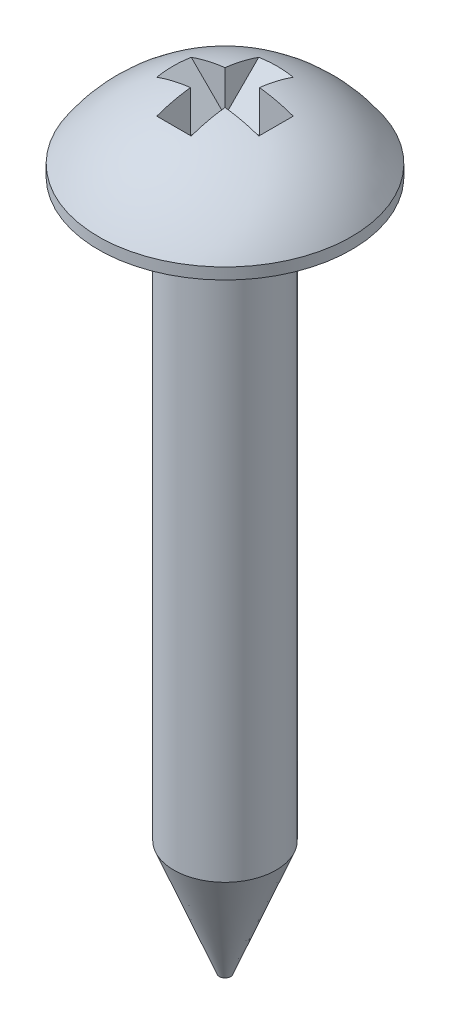
ISO-10303-21;
HEADER;
FILE_DESCRIPTION(('STEP AP214'),'2;1');
FILE_NAME('part.step','',(''),(''),'','','');
FILE_SCHEMA(('AUTOMOTIVE_DESIGN { 1 0 10303 214 1 1 1 1 }'));
ENDSEC;
DATA;
#1=APPLICATION_CONTEXT('core data for automotive mechanical design processes');
#2=APPLICATION_PROTOCOL_DEFINITION('international standard','automotive_design',2000,#1);
#3=PRODUCT_CONTEXT('',#1,'mechanical');
#4=PRODUCT('Part','Part','',(#3));
#5=PRODUCT_RELATED_PRODUCT_CATEGORY('part','',(#4));
#6=PRODUCT_DEFINITION_FORMATION('','',#4);
#7=PRODUCT_DEFINITION_CONTEXT('part definition',#1,'design');
#8=PRODUCT_DEFINITION('design','',#6,#7);
#9=PRODUCT_DEFINITION_SHAPE('','',#8);
#10=(LENGTH_UNIT() NAMED_UNIT(*) SI_UNIT(.MILLI.,.METRE.));
#11=(NAMED_UNIT(*) PLANE_ANGLE_UNIT() SI_UNIT($,.RADIAN.));
#12=(NAMED_UNIT(*) SI_UNIT($,.STERADIAN.) SOLID_ANGLE_UNIT());
#13=UNCERTAINTY_MEASURE_WITH_UNIT(LENGTH_MEASURE(1.E-05),#10,'distance_accuracy_value','');
#14=(GEOMETRIC_REPRESENTATION_CONTEXT(3) GLOBAL_UNCERTAINTY_ASSIGNED_CONTEXT((#13)) GLOBAL_UNIT_ASSIGNED_CONTEXT((#10,
#11,#12)) REPRESENTATION_CONTEXT('',''));
#15=CARTESIAN_POINT('',(0.,0.,0.));
#16=DIRECTION('',(0.,0.,1.));
#17=DIRECTION('',(1.,0.,0.));
#18=AXIS2_PLACEMENT_3D('',#15,#16,#17);
#19=CARTESIAN_POINT('',(0.,-1.60214533333333,0.));
#20=DIRECTION('',(0.,-1.,0.));
#21=DIRECTION('',(1.,0.,0.));
#22=AXIS2_PLACEMENT_3D('',#19,#20,#21);
#23=SPHERICAL_SURFACE('',#22,3.35214533333333);
#24=CARTESIAN_POINT('',(0.,0.25,0.));
#25=DIRECTION('',(0.,-1.,0.));
#26=DIRECTION('',(0.,0.,-1.));
#27=AXIS2_PLACEMENT_3D('',#24,#25,#26);
#28=CIRCLE('',#27,2.794);
#29=CARTESIAN_POINT('',(0.,0.25,-2.794));
#30=VERTEX_POINT('',#29);
#31=EDGE_CURVE('E167',#30,#30,#28,.T.);
#32=ORIENTED_EDGE('',*,*,#31,.F.);
#33=EDGE_LOOP('',(#32));
#34=FACE_BOUND('',#33,.T.);
#35=CARTESIAN_POINT('',(0.,-0.598016146644055,1.00412918668928));
#36=DIRECTION('',(0.,-0.707106781186548,-0.707106781186547));
#37=DIRECTION('',(0.,0.707106781186547,-0.707106781186548));
#38=AXIS2_PLACEMENT_3D('',#35,#36,#37);
#39=CIRCLE('',#38,3.03649921598309);
#40=CARTESIAN_POINT('',(0.381000000000004,1.53214423331163,-1.12603119326641));
#41=VERTEX_POINT('',#40);
#42=CARTESIAN_POINT('',(-0.380999999999996,1.53214423331163,-1.12603119326641));
#43=VERTEX_POINT('',#42);
#44=EDGE_CURVE('E152',#41,#43,#39,.F.);
#45=ORIENTED_EDGE('',*,*,#44,.F.);
#46=CARTESIAN_POINT('',(0.381,-1.60214533333333,0.));
#47=DIRECTION('',(-1.,0.,0.));
#48=DIRECTION('',(0.,0.,1.));
#49=AXIS2_PLACEMENT_3D('',#46,#47,#48);
#50=CIRCLE('',#49,3.33042299652588);
#51=CARTESIAN_POINT('',(0.381000000000001,1.70641271146329,-0.381));
#52=VERTEX_POINT('',#51);
#53=EDGE_CURVE('E105',#41,#52,#50,.F.);
#54=ORIENTED_EDGE('',*,*,#53,.T.);
#55=CARTESIAN_POINT('',(0.,-1.60214533333333,-0.381));
#56=DIRECTION('',(0.,0.,1.));
#57=DIRECTION('',(1.,0.,0.));
#58=AXIS2_PLACEMENT_3D('',#55,#56,#57);
#59=CIRCLE('',#58,3.33042299652588);
#60=CARTESIAN_POINT('',(1.12603119326641,1.53214423331163,-0.381));
#61=VERTEX_POINT('',#60);
#62=EDGE_CURVE('E128',#52,#61,#59,.F.);
#63=ORIENTED_EDGE('',*,*,#62,.T.);
#64=CARTESIAN_POINT('',(-1.00412918668928,-0.598016146644056,0.));
#65=DIRECTION('',(0.707106781186547,-0.707106781186548,0.));
#66=DIRECTION('',(0.707106781186548,0.707106781186547,0.));
#67=AXIS2_PLACEMENT_3D('',#64,#65,#66);
#68=CIRCLE('',#67,3.03649921598309);
#69=CARTESIAN_POINT('',(1.12603119326641,1.53214423331163,0.381));
#70=VERTEX_POINT('',#69);
#71=EDGE_CURVE('E146',#70,#61,#68,.F.);
#72=ORIENTED_EDGE('',*,*,#71,.F.);
#73=CARTESIAN_POINT('',(0.,-1.60214533333333,0.381));
#74=DIRECTION('',(0.,0.,1.));
#75=DIRECTION('',(1.,0.,0.));
#76=AXIS2_PLACEMENT_3D('',#73,#74,#75);
#77=CIRCLE('',#76,3.33042299652588);
#78=CARTESIAN_POINT('',(0.380999999999999,1.70641271146329,0.381));
#79=VERTEX_POINT('',#78);
#80=EDGE_CURVE('E170',#79,#70,#77,.F.);
#81=ORIENTED_EDGE('',*,*,#80,.F.);
#82=CARTESIAN_POINT('',(0.380999999999996,1.53214423331163,1.12603119326641));
#83=VERTEX_POINT('',#82);
#84=EDGE_CURVE('E129',#79,#83,#50,.F.);
#85=ORIENTED_EDGE('',*,*,#84,.T.);
#86=CARTESIAN_POINT('',(0.,-0.598016146644056,-1.00412918668928));
#87=DIRECTION('',(0.,-0.707106781186548,0.707106781186547));
#88=DIRECTION('',(0.,-0.707106781186547,-0.707106781186548));
#89=AXIS2_PLACEMENT_3D('',#86,#87,#88);
#90=CIRCLE('',#89,3.03649921598309);
#91=CARTESIAN_POINT('',(-0.381000000000004,1.53214423331163,1.12603119326641));
#92=VERTEX_POINT('',#91);
#93=EDGE_CURVE('E191',#92,#83,#90,.F.);
#94=ORIENTED_EDGE('',*,*,#93,.F.);
#95=CARTESIAN_POINT('',(-0.381,-1.60214533333333,0.));
#96=DIRECTION('',(-1.,0.,0.));
#97=DIRECTION('',(0.,0.,1.));
#98=AXIS2_PLACEMENT_3D('',#95,#96,#97);
#99=CIRCLE('',#98,3.33042299652588);
#100=CARTESIAN_POINT('',(-0.381000000000001,1.70641271146329,0.381));
#101=VERTEX_POINT('',#100);
#102=EDGE_CURVE('E189',#101,#92,#99,.F.);
#103=ORIENTED_EDGE('',*,*,#102,.F.);
#104=CARTESIAN_POINT('',(-1.12603119326641,1.53214423331163,0.381));
#105=VERTEX_POINT('',#104);
#106=EDGE_CURVE('E171',#105,#101,#77,.F.);
#107=ORIENTED_EDGE('',*,*,#106,.F.);
#108=CARTESIAN_POINT('',(1.00412918668928,-0.598016146644055,0.));
#109=DIRECTION('',(-0.707106781186547,-0.707106781186548,0.));
#110=DIRECTION('',(0.707106781186548,-0.707106781186547,0.));
#111=AXIS2_PLACEMENT_3D('',#108,#109,#110);
#112=CIRCLE('',#111,3.03649921598309);
#113=CARTESIAN_POINT('',(-1.12603119326641,1.53214423331163,-0.381));
#114=VERTEX_POINT('',#113);
#115=EDGE_CURVE('E173',#114,#105,#112,.F.);
#116=ORIENTED_EDGE('',*,*,#115,.F.);
#117=CARTESIAN_POINT('',(-0.380999999999999,1.70641271146329,-0.381));
#118=VERTEX_POINT('',#117);
#119=EDGE_CURVE('E176',#114,#118,#59,.F.);
#120=ORIENTED_EDGE('',*,*,#119,.T.);
#121=EDGE_CURVE('E48',#43,#118,#99,.F.);
#122=ORIENTED_EDGE('',*,*,#121,.F.);
#123=EDGE_LOOP('',(#45,#54,#63,#72,#81,#85,#94,#103,#107,#116,#120,#122));
#124=FACE_BOUND('',#123,.T.);
#125=ADVANCED_FACE('F33',(#34,#124),#23,.T.);
#126=CARTESIAN_POINT('',(0.,0.,-0.381));
#127=DIRECTION('',(0.,0.,1.));
#128=DIRECTION('',(1.,0.,0.));
#129=AXIS2_PLACEMENT_3D('',#126,#127,#128);
#130=PLANE('',#129);
#131=ORIENTED_EDGE('',*,*,#62,.F.);
#132=DIRECTION('',(0.,-1.,0.));
#133=VECTOR('',#132,1.);
#134=CARTESIAN_POINT('',(0.381000000000001,0.,-0.381));
#135=LINE('',#134,#133);
#136=CARTESIAN_POINT('',(0.381000000000001,0.78711304004522,-0.380999999999999));
#137=VERTEX_POINT('',#136);
#138=EDGE_CURVE('E103',#52,#137,#135,.T.);
#139=ORIENTED_EDGE('',*,*,#138,.T.);
#140=DIRECTION('',(0.707106781186548,0.707106781186547,0.));
#141=VECTOR('',#140,1.);
#142=CARTESIAN_POINT('',(0.381,0.78711304004522,-0.381));
#143=LINE('',#142,#141);
#144=EDGE_CURVE('E120',#137,#61,#143,.T.);
#145=ORIENTED_EDGE('',*,*,#144,.T.);
#146=EDGE_LOOP('',(#131,#139,#145));
#147=FACE_BOUND('',#146,.T.);
#148=ADVANCED_FACE('F126',(#147),#130,.T.);
#149=CARTESIAN_POINT('',(0.,0.,0.381));
#150=DIRECTION('',(0.,0.,1.));
#151=DIRECTION('',(1.,0.,0.));
#152=AXIS2_PLACEMENT_3D('',#149,#150,#151);
#153=PLANE('',#152);
#154=DIRECTION('',(0.,-1.,0.));
#155=VECTOR('',#154,1.);
#156=CARTESIAN_POINT('',(0.380999999999999,0.,0.381));
#157=LINE('',#156,#155);
#158=CARTESIAN_POINT('',(0.380999999999999,0.78711304004522,0.381000000000001));
#159=VERTEX_POINT('',#158);
#160=EDGE_CURVE('E11',#79,#159,#157,.T.);
#161=ORIENTED_EDGE('',*,*,#160,.F.);
#162=ORIENTED_EDGE('',*,*,#80,.T.);
#163=DIRECTION('',(0.707106781186548,0.707106781186547,0.));
#164=VECTOR('',#163,1.);
#165=CARTESIAN_POINT('',(0.381,0.78711304004522,0.381));
#166=LINE('',#165,#164);
#167=EDGE_CURVE('E154',#159,#70,#166,.T.);
#168=ORIENTED_EDGE('',*,*,#167,.F.);
#169=EDGE_LOOP('',(#161,#162,#168));
#170=FACE_BOUND('',#169,.T.);
#171=ADVANCED_FACE('F227',(#170),#153,.F.);
#172=CARTESIAN_POINT('',(0.,-15.24,0.));
#173=DIRECTION('',(0.,-1.,0.));
#174=DIRECTION('',(0.,0.,-1.));
#175=AXIS2_PLACEMENT_3D('',#172,#173,#174);
#176=PLANE('',#175);
#177=CARTESIAN_POINT('',(0.,-15.24,0.));
#178=DIRECTION('',(0.,-1.,0.));
#179=DIRECTION('',(0.,0.,-1.));
#180=AXIS2_PLACEMENT_3D('',#177,#178,#179);
#181=CIRCLE('',#180,0.125);
#182=CARTESIAN_POINT('',(0.,-15.24,-0.125));
#183=VERTEX_POINT('',#182);
#184=EDGE_CURVE('E140',#183,#183,#181,.T.);
#185=ORIENTED_EDGE('',*,*,#184,.T.);
#186=EDGE_LOOP('',(#185));
#187=FACE_BOUND('',#186,.T.);
#188=ADVANCED_FACE('F35',(#187),#176,.T.);
#189=CARTESIAN_POINT('',(0.,0.,0.));
#190=DIRECTION('',(0.,-1.,0.));
#191=DIRECTION('',(0.,0.,-1.));
#192=AXIS2_PLACEMENT_3D('',#189,#190,#191);
#193=CYLINDRICAL_SURFACE('',#192,2.794);
#194=ORIENTED_EDGE('',*,*,#31,.T.);
#195=EDGE_LOOP('',(#194));
#196=FACE_BOUND('',#195,.T.);
#197=CARTESIAN_POINT('',(0.,0.,0.));
#198=DIRECTION('',(0.,-1.,0.));
#199=DIRECTION('',(0.,0.,-1.));
#200=AXIS2_PLACEMENT_3D('',#197,#198,#199);
#201=CIRCLE('',#200,2.794);
#202=CARTESIAN_POINT('',(0.,0.,-2.794));
#203=VERTEX_POINT('',#202);
#204=EDGE_CURVE('E164',#203,#203,#201,.T.);
#205=ORIENTED_EDGE('',*,*,#204,.F.);
#206=EDGE_LOOP('',(#205));
#207=FACE_BOUND('',#206,.T.);
#208=ADVANCED_FACE('F231',(#196,#207),#193,.T.);
#209=CARTESIAN_POINT('',(1.13,0.,0.));
#210=DIRECTION('',(0.,-1.,0.));
#211=DIRECTION('',(0.,0.,-1.));
#212=AXIS2_PLACEMENT_3D('',#209,#210,#211);
#213=PLANE('',#212);
#214=ORIENTED_EDGE('',*,*,#204,.T.);
#215=EDGE_LOOP('',(#214));
#216=FACE_BOUND('',#215,.T.);
#217=CARTESIAN_POINT('',(0.,0.,0.));
#218=DIRECTION('',(0.,-1.,0.));
#219=DIRECTION('',(0.,0.,-1.));
#220=AXIS2_PLACEMENT_3D('',#217,#218,#219);
#221=CIRCLE('',#220,1.13);
#222=CARTESIAN_POINT('',(0.,0.,-1.13));
#223=VERTEX_POINT('',#222);
#224=EDGE_CURVE('E161',#223,#223,#221,.T.);
#225=ORIENTED_EDGE('',*,*,#224,.F.);
#226=EDGE_LOOP('',(#225));
#227=FACE_BOUND('',#226,.T.);
#228=ADVANCED_FACE('F234',(#216,#227),#213,.T.);
#229=CARTESIAN_POINT('',(0.,0.,0.));
#230=DIRECTION('',(0.,-1.,0.));
#231=DIRECTION('',(0.,0.,-1.));
#232=AXIS2_PLACEMENT_3D('',#229,#230,#231);
#233=CYLINDRICAL_SURFACE('',#232,1.13);
#234=ORIENTED_EDGE('',*,*,#224,.T.);
#235=EDGE_LOOP('',(#234));
#236=FACE_BOUND('',#235,.T.);
#237=CARTESIAN_POINT('',(0.,-12.7,0.));
#238=DIRECTION('',(0.,-1.,0.));
#239=DIRECTION('',(0.,0.,-1.));
#240=AXIS2_PLACEMENT_3D('',#237,#238,#239);
#241=CIRCLE('',#240,1.13);
#242=CARTESIAN_POINT('',(0.,-12.7,-1.13));
#243=VERTEX_POINT('',#242);
#244=EDGE_CURVE('E158',#243,#243,#241,.T.);
#245=ORIENTED_EDGE('',*,*,#244,.F.);
#246=EDGE_LOOP('',(#245));
#247=FACE_BOUND('',#246,.T.);
#248=ADVANCED_FACE('F238',(#236,#247),#233,.T.);
#249=CARTESIAN_POINT('',(0.,-15.24,0.));
#250=DIRECTION('',(0.,1.,0.));
#251=DIRECTION('',(0.,0.,1.));
#252=AXIS2_PLACEMENT_3D('',#249,#250,#251);
#253=CONICAL_SURFACE('',#252,0.125,0.37676744144232);
#254=ORIENTED_EDGE('',*,*,#244,.T.);
#255=EDGE_LOOP('',(#254));
#256=FACE_BOUND('',#255,.T.);
#257=ORIENTED_EDGE('',*,*,#184,.F.);
#258=EDGE_LOOP('',(#257));
#259=FACE_BOUND('',#258,.T.);
#260=ADVANCED_FACE('F242',(#256,#259),#253,.T.);
#261=CARTESIAN_POINT('',(0.381,0.78711304004522,-0.381));
#262=DIRECTION('',(0.707106781186547,-0.707106781186548,0.));
#263=DIRECTION('',(0.707106781186548,0.707106781186547,0.));
#264=AXIS2_PLACEMENT_3D('',#261,#262,#263);
#265=PLANE('',#264);
#266=ORIENTED_EDGE('',*,*,#71,.T.);
#267=ORIENTED_EDGE('',*,*,#144,.F.);
#268=DIRECTION('',(0.,0.,1.));
#269=VECTOR('',#268,1.);
#270=CARTESIAN_POINT('',(0.381,0.78711304004522,-0.381));
#271=LINE('',#270,#269);
#272=EDGE_CURVE('E133',#137,#159,#271,.T.);
#273=ORIENTED_EDGE('',*,*,#272,.T.);
#274=ORIENTED_EDGE('',*,*,#167,.T.);
#275=EDGE_LOOP('',(#266,#267,#273,#274));
#276=FACE_BOUND('',#275,.T.);
#277=ADVANCED_FACE('F144',(#276),#265,.F.);
#278=CARTESIAN_POINT('',(-0.381,0.78711304004522,-0.381));
#279=DIRECTION('',(0.,-1.,0.));
#280=DIRECTION('',(0.,0.,-1.));
#281=AXIS2_PLACEMENT_3D('',#278,#279,#280);
#282=PLANE('',#281);
#283=DIRECTION('',(1.,0.,0.));
#284=VECTOR('',#283,1.);
#285=CARTESIAN_POINT('',(-0.381,0.78711304004522,0.381));
#286=LINE('',#285,#284);
#287=CARTESIAN_POINT('',(-0.381,0.78711304004522,0.381));
#288=VERTEX_POINT('',#287);
#289=EDGE_CURVE('E136',#288,#159,#286,.T.);
#290=ORIENTED_EDGE('',*,*,#289,.T.);
#291=ORIENTED_EDGE('',*,*,#272,.F.);
#292=DIRECTION('',(1.,0.,0.));
#293=VECTOR('',#292,1.);
#294=CARTESIAN_POINT('',(-0.381,0.78711304004522,-0.381));
#295=LINE('',#294,#293);
#296=CARTESIAN_POINT('',(-0.380999999999999,0.78711304004522,-0.381000000000001));
#297=VERTEX_POINT('',#296);
#298=EDGE_CURVE('E113',#297,#137,#295,.T.);
#299=ORIENTED_EDGE('',*,*,#298,.F.);
#300=DIRECTION('',(0.,0.,1.));
#301=VECTOR('',#300,1.);
#302=CARTESIAN_POINT('',(-0.381,0.78711304004522,-0.381));
#303=LINE('',#302,#301);
#304=EDGE_CURVE('E141',#297,#288,#303,.T.);
#305=ORIENTED_EDGE('',*,*,#304,.T.);
#306=EDGE_LOOP('',(#290,#291,#299,#305));
#307=FACE_BOUND('',#306,.T.);
#308=ADVANCED_FACE('F134',(#307),#282,.F.);
#309=CARTESIAN_POINT('',(-1.8,2.20611304004522,-0.381));
#310=DIRECTION('',(-0.707106781186547,-0.707106781186548,0.));
#311=DIRECTION('',(0.707106781186548,-0.707106781186547,0.));
#312=AXIS2_PLACEMENT_3D('',#309,#310,#311);
#313=PLANE('',#312);
#314=ORIENTED_EDGE('',*,*,#115,.T.);
#315=DIRECTION('',(0.707106781186548,-0.707106781186547,0.));
#316=VECTOR('',#315,1.);
#317=CARTESIAN_POINT('',(-1.8,2.20611304004522,0.381));
#318=LINE('',#317,#316);
#319=EDGE_CURVE('E56',#105,#288,#318,.T.);
#320=ORIENTED_EDGE('',*,*,#319,.T.);
#321=ORIENTED_EDGE('',*,*,#304,.F.);
#322=DIRECTION('',(0.707106781186548,-0.707106781186547,0.));
#323=VECTOR('',#322,1.);
#324=CARTESIAN_POINT('',(-1.8,2.20611304004522,-0.381));
#325=LINE('',#324,#323);
#326=EDGE_CURVE('E121',#114,#297,#325,.T.);
#327=ORIENTED_EDGE('',*,*,#326,.F.);
#328=EDGE_LOOP('',(#314,#320,#321,#327));
#329=FACE_BOUND('',#328,.T.);
#330=ADVANCED_FACE('F184',(#329),#313,.F.);
#331=DIRECTION('',(0.,-1.,0.));
#332=VECTOR('',#331,1.);
#333=CARTESIAN_POINT('',(-0.380999999999999,0.,-0.381));
#334=LINE('',#333,#332);
#335=EDGE_CURVE('E193',#118,#297,#334,.T.);
#336=ORIENTED_EDGE('',*,*,#335,.F.);
#337=ORIENTED_EDGE('',*,*,#119,.F.);
#338=ORIENTED_EDGE('',*,*,#326,.T.);
#339=EDGE_LOOP('',(#336,#337,#338));
#340=FACE_BOUND('',#339,.T.);
#341=ADVANCED_FACE('F206',(#340),#130,.T.);
#342=ORIENTED_EDGE('',*,*,#106,.T.);
#343=DIRECTION('',(0.,-1.,0.));
#344=VECTOR('',#343,1.);
#345=CARTESIAN_POINT('',(-0.381000000000001,0.,0.381));
#346=LINE('',#345,#344);
#347=EDGE_CURVE('E41',#101,#288,#346,.T.);
#348=ORIENTED_EDGE('',*,*,#347,.T.);
#349=ORIENTED_EDGE('',*,*,#319,.F.);
#350=EDGE_LOOP('',(#342,#348,#349));
#351=FACE_BOUND('',#350,.T.);
#352=ADVANCED_FACE('F178',(#351),#153,.F.);
#353=CARTESIAN_POINT('',(0.381,0.,0.));
#354=DIRECTION('',(-1.,0.,0.));
#355=DIRECTION('',(0.,0.,1.));
#356=AXIS2_PLACEMENT_3D('',#353,#354,#355);
#357=PLANE('',#356);
#358=ORIENTED_EDGE('',*,*,#160,.T.);
#359=DIRECTION('',(0.,0.707106781186547,0.707106781186548));
#360=VECTOR('',#359,1.);
#361=CARTESIAN_POINT('',(0.380999999999999,0.78711304004522,0.381000000000001));
#362=LINE('',#361,#360);
#363=EDGE_CURVE('E108',#159,#83,#362,.T.);
#364=ORIENTED_EDGE('',*,*,#363,.T.);
#365=ORIENTED_EDGE('',*,*,#84,.F.);
#366=EDGE_LOOP('',(#358,#364,#365));
#367=FACE_BOUND('',#366,.T.);
#368=ADVANCED_FACE('F212',(#367),#357,.T.);
#369=CARTESIAN_POINT('',(-0.381,0.,0.));
#370=DIRECTION('',(-1.,0.,0.));
#371=DIRECTION('',(0.,0.,1.));
#372=AXIS2_PLACEMENT_3D('',#369,#370,#371);
#373=PLANE('',#372);
#374=ORIENTED_EDGE('',*,*,#102,.T.);
#375=DIRECTION('',(0.,0.707106781186547,0.707106781186548));
#376=VECTOR('',#375,1.);
#377=CARTESIAN_POINT('',(-0.381000000000001,0.78711304004522,0.380999999999999));
#378=LINE('',#377,#376);
#379=EDGE_CURVE('E109',#288,#92,#378,.T.);
#380=ORIENTED_EDGE('',*,*,#379,.F.);
#381=ORIENTED_EDGE('',*,*,#347,.F.);
#382=EDGE_LOOP('',(#374,#380,#381));
#383=FACE_BOUND('',#382,.T.);
#384=ADVANCED_FACE('F210',(#383),#373,.F.);
#385=CARTESIAN_POINT('',(0.380999999999999,0.78711304004522,0.381000000000001));
#386=DIRECTION('',(0.,-0.707106781186548,0.707106781186547));
#387=DIRECTION('',(0.,-0.707106781186547,-0.707106781186548));
#388=AXIS2_PLACEMENT_3D('',#385,#386,#387);
#389=PLANE('',#388);
#390=ORIENTED_EDGE('',*,*,#93,.T.);
#391=ORIENTED_EDGE('',*,*,#363,.F.);
#392=ORIENTED_EDGE('',*,*,#289,.F.);
#393=ORIENTED_EDGE('',*,*,#379,.T.);
#394=EDGE_LOOP('',(#390,#391,#392,#393));
#395=FACE_BOUND('',#394,.T.);
#396=ADVANCED_FACE('F209',(#395),#389,.F.);
#397=DIRECTION('',(0.,-0.707106781186547,0.707106781186548));
#398=VECTOR('',#397,1.);
#399=CARTESIAN_POINT('',(0.381000000000006,2.20611304004522,-1.8));
#400=LINE('',#399,#398);
#401=EDGE_CURVE('E99',#41,#137,#400,.T.);
#402=ORIENTED_EDGE('',*,*,#401,.T.);
#403=ORIENTED_EDGE('',*,*,#138,.F.);
#404=ORIENTED_EDGE('',*,*,#53,.F.);
#405=EDGE_LOOP('',(#402,#403,#404));
#406=FACE_BOUND('',#405,.T.);
#407=ADVANCED_FACE('F101',(#406),#357,.T.);
#408=ORIENTED_EDGE('',*,*,#121,.T.);
#409=ORIENTED_EDGE('',*,*,#335,.T.);
#410=DIRECTION('',(0.,-0.707106781186547,0.707106781186548));
#411=VECTOR('',#410,1.);
#412=CARTESIAN_POINT('',(-0.380999999999994,2.20611304004522,-1.8));
#413=LINE('',#412,#411);
#414=EDGE_CURVE('E115',#43,#297,#413,.T.);
#415=ORIENTED_EDGE('',*,*,#414,.F.);
#416=EDGE_LOOP('',(#408,#409,#415));
#417=FACE_BOUND('',#416,.T.);
#418=ADVANCED_FACE('F207',(#417),#373,.F.);
#419=CARTESIAN_POINT('',(0.381000000000006,2.20611304004522,-1.8));
#420=DIRECTION('',(0.,-0.707106781186548,-0.707106781186547));
#421=DIRECTION('',(0.,0.707106781186547,-0.707106781186548));
#422=AXIS2_PLACEMENT_3D('',#419,#420,#421);
#423=PLANE('',#422);
#424=ORIENTED_EDGE('',*,*,#44,.T.);
#425=ORIENTED_EDGE('',*,*,#414,.T.);
#426=ORIENTED_EDGE('',*,*,#298,.T.);
#427=ORIENTED_EDGE('',*,*,#401,.F.);
#428=EDGE_LOOP('',(#424,#425,#426,#427));
#429=FACE_BOUND('',#428,.T.);
#430=ADVANCED_FACE('F114',(#429),#423,.F.);
#431=CLOSED_SHELL('',(#125,#148,#171,#188,#208,#228,#248,#260,#277,#308,#330,#341,#352,#368,
#384,#396,#407,#418,#430));
#432=MANIFOLD_SOLID_BREP('B2',#431);
#433=ADVANCED_BREP_SHAPE_REPRESENTATION('',(#18,#432),#14);
#434=SHAPE_DEFINITION_REPRESENTATION(#9,#433);
ENDSEC;
END-ISO-10303-21;
